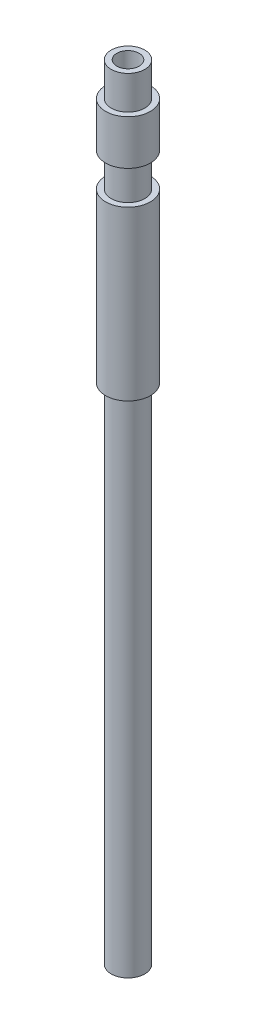
ISO-10303-21;
HEADER;
FILE_DESCRIPTION(('STEP AP214'),'2;1');
FILE_NAME('part.step','',(''),(''),'','','');
FILE_SCHEMA(('AUTOMOTIVE_DESIGN { 1 0 10303 214 1 1 1 1 }'));
ENDSEC;
DATA;
#1=APPLICATION_CONTEXT('core data for automotive mechanical design processes');
#2=APPLICATION_PROTOCOL_DEFINITION('international standard','automotive_design',2000,#1);
#3=PRODUCT_CONTEXT('',#1,'mechanical');
#4=PRODUCT('Part','Part','',(#3));
#5=PRODUCT_RELATED_PRODUCT_CATEGORY('part','',(#4));
#6=PRODUCT_DEFINITION_FORMATION('','',#4);
#7=PRODUCT_DEFINITION_CONTEXT('part definition',#1,'design');
#8=PRODUCT_DEFINITION('design','',#6,#7);
#9=PRODUCT_DEFINITION_SHAPE('','',#8);
#10=(LENGTH_UNIT() NAMED_UNIT(*) SI_UNIT(.MILLI.,.METRE.));
#11=(NAMED_UNIT(*) PLANE_ANGLE_UNIT() SI_UNIT($,.RADIAN.));
#12=(NAMED_UNIT(*) SI_UNIT($,.STERADIAN.) SOLID_ANGLE_UNIT());
#13=UNCERTAINTY_MEASURE_WITH_UNIT(LENGTH_MEASURE(1.E-05),#10,'distance_accuracy_value','');
#14=(GEOMETRIC_REPRESENTATION_CONTEXT(3) GLOBAL_UNCERTAINTY_ASSIGNED_CONTEXT((#13)) GLOBAL_UNIT_ASSIGNED_CONTEXT((#10,
#11,#12)) REPRESENTATION_CONTEXT('',''));
#15=CARTESIAN_POINT('',(0.,0.,0.));
#16=DIRECTION('',(0.,0.,1.));
#17=DIRECTION('',(1.,0.,0.));
#18=AXIS2_PLACEMENT_3D('',#15,#16,#17);
#19=CARTESIAN_POINT('',(0.,0.,0.));
#20=DIRECTION('',(0.,1.,0.));
#21=DIRECTION('',(0.,0.,1.));
#22=AXIS2_PLACEMENT_3D('',#19,#20,#21);
#23=PLANE('',#22);
#24=CARTESIAN_POINT('',(0.,0.,0.));
#25=DIRECTION('',(0.,1.,0.));
#26=DIRECTION('',(0.,0.,1.));
#27=AXIS2_PLACEMENT_3D('',#24,#25,#26);
#28=CIRCLE('',#27,1.);
#29=CARTESIAN_POINT('',(0.,0.,1.));
#30=VERTEX_POINT('',#29);
#31=EDGE_CURVE('E37',#30,#30,#28,.T.);
#32=ORIENTED_EDGE('',*,*,#31,.T.);
#33=EDGE_LOOP('',(#32));
#34=FACE_BOUND('',#33,.T.);
#35=CARTESIAN_POINT('',(0.,0.,0.));
#36=DIRECTION('',(0.,-1.,0.));
#37=DIRECTION('',(0.,0.,-1.));
#38=AXIS2_PLACEMENT_3D('',#35,#36,#37);
#39=CIRCLE('',#38,1.5);
#40=CARTESIAN_POINT('',(0.,0.,-1.5));
#41=VERTEX_POINT('',#40);
#42=EDGE_CURVE('E72',#41,#41,#39,.T.);
#43=ORIENTED_EDGE('',*,*,#42,.T.);
#44=EDGE_LOOP('',(#43));
#45=FACE_BOUND('',#44,.T.);
#46=ADVANCED_FACE('F33',(#34,#45),#23,.F.);
#47=CARTESIAN_POINT('',(0.,70.,0.));
#48=DIRECTION('',(0.,-1.,0.));
#49=DIRECTION('',(0.,0.,-1.));
#50=AXIS2_PLACEMENT_3D('',#47,#48,#49);
#51=CYLINDRICAL_SURFACE('',#50,2.);
#52=CARTESIAN_POINT('',(0.,45.,0.));
#53=DIRECTION('',(0.,-1.,0.));
#54=DIRECTION('',(0.,0.,-1.));
#55=AXIS2_PLACEMENT_3D('',#52,#53,#54);
#56=CIRCLE('',#55,1.99999999999999);
#57=CARTESIAN_POINT('',(0.,45.,-1.99999999999999));
#58=VERTEX_POINT('',#57);
#59=EDGE_CURVE('E66',#58,#58,#56,.T.);
#60=ORIENTED_EDGE('',*,*,#59,.F.);
#61=EDGE_LOOP('',(#60));
#62=FACE_BOUND('',#61,.T.);
#63=CARTESIAN_POINT('',(0.,60.,0.));
#64=DIRECTION('',(0.,1.,0.));
#65=DIRECTION('',(0.,0.,1.));
#66=AXIS2_PLACEMENT_3D('',#63,#64,#65);
#67=CIRCLE('',#66,2.);
#68=CARTESIAN_POINT('',(0.,60.,2.));
#69=VERTEX_POINT('',#68);
#70=EDGE_CURVE('E54',#69,#69,#67,.T.);
#71=ORIENTED_EDGE('',*,*,#70,.F.);
#72=EDGE_LOOP('',(#71));
#73=FACE_BOUND('',#72,.T.);
#74=ADVANCED_FACE('F35',(#62,#73),#51,.T.);
#75=CARTESIAN_POINT('',(0.,67.,0.));
#76=DIRECTION('',(0.,1.,0.));
#77=DIRECTION('',(0.,0.,1.));
#78=AXIS2_PLACEMENT_3D('',#75,#76,#77);
#79=CIRCLE('',#78,2.);
#80=CARTESIAN_POINT('',(0.,67.,2.));
#81=VERTEX_POINT('',#80);
#82=EDGE_CURVE('E44',#81,#81,#79,.T.);
#83=ORIENTED_EDGE('',*,*,#82,.F.);
#84=EDGE_LOOP('',(#83));
#85=FACE_BOUND('',#84,.T.);
#86=CARTESIAN_POINT('',(0.,63.,0.));
#87=DIRECTION('',(0.,1.,0.));
#88=DIRECTION('',(0.,0.,1.));
#89=AXIS2_PLACEMENT_3D('',#86,#87,#88);
#90=CIRCLE('',#89,2.);
#91=CARTESIAN_POINT('',(0.,63.,2.));
#92=VERTEX_POINT('',#91);
#93=EDGE_CURVE('E63',#92,#92,#90,.T.);
#94=ORIENTED_EDGE('',*,*,#93,.T.);
#95=EDGE_LOOP('',(#94));
#96=FACE_BOUND('',#95,.T.);
#97=ADVANCED_FACE('F92',(#85,#96),#51,.T.);
#98=CARTESIAN_POINT('',(0.,70.,0.));
#99=DIRECTION('',(0.,1.,0.));
#100=DIRECTION('',(0.,0.,1.));
#101=AXIS2_PLACEMENT_3D('',#98,#99,#100);
#102=PLANE('',#101);
#103=CARTESIAN_POINT('',(0.,70.,0.));
#104=DIRECTION('',(0.,1.,0.));
#105=DIRECTION('',(0.,0.,1.));
#106=AXIS2_PLACEMENT_3D('',#103,#104,#105);
#107=CIRCLE('',#106,1.);
#108=CARTESIAN_POINT('',(0.,70.,1.));
#109=VERTEX_POINT('',#108);
#110=EDGE_CURVE('E10',#109,#109,#107,.T.);
#111=ORIENTED_EDGE('',*,*,#110,.F.);
#112=EDGE_LOOP('',(#111));
#113=FACE_BOUND('',#112,.T.);
#114=CARTESIAN_POINT('',(0.,70.,0.));
#115=DIRECTION('',(0.,1.,0.));
#116=DIRECTION('',(0.,0.,1.));
#117=AXIS2_PLACEMENT_3D('',#114,#115,#116);
#118=CIRCLE('',#117,1.5);
#119=CARTESIAN_POINT('',(0.,70.,1.5));
#120=VERTEX_POINT('',#119);
#121=EDGE_CURVE('E51',#120,#120,#118,.T.);
#122=ORIENTED_EDGE('',*,*,#121,.T.);
#123=EDGE_LOOP('',(#122));
#124=FACE_BOUND('',#123,.T.);
#125=ADVANCED_FACE('F114',(#113,#124),#102,.T.);
#126=CARTESIAN_POINT('',(0.,70.,0.));
#127=DIRECTION('',(0.,-1.,0.));
#128=DIRECTION('',(0.,0.,-1.));
#129=AXIS2_PLACEMENT_3D('',#126,#127,#128);
#130=CYLINDRICAL_SURFACE('',#129,1.);
#131=ORIENTED_EDGE('',*,*,#110,.T.);
#132=EDGE_LOOP('',(#131));
#133=FACE_BOUND('',#132,.T.);
#134=ORIENTED_EDGE('',*,*,#31,.F.);
#135=EDGE_LOOP('',(#134));
#136=FACE_BOUND('',#135,.T.);
#137=ADVANCED_FACE('F119',(#133,#136),#130,.F.);
#138=CARTESIAN_POINT('',(2.,67.,0.));
#139=DIRECTION('',(0.,1.,0.));
#140=DIRECTION('',(0.,0.,1.));
#141=AXIS2_PLACEMENT_3D('',#138,#139,#140);
#142=PLANE('',#141);
#143=ORIENTED_EDGE('',*,*,#82,.T.);
#144=EDGE_LOOP('',(#143));
#145=FACE_BOUND('',#144,.T.);
#146=CARTESIAN_POINT('',(0.,67.,0.));
#147=DIRECTION('',(0.,1.,0.));
#148=DIRECTION('',(0.,0.,1.));
#149=AXIS2_PLACEMENT_3D('',#146,#147,#148);
#150=CIRCLE('',#149,1.5);
#151=CARTESIAN_POINT('',(0.,67.,1.5));
#152=VERTEX_POINT('',#151);
#153=EDGE_CURVE('E48',#152,#152,#150,.T.);
#154=ORIENTED_EDGE('',*,*,#153,.F.);
#155=EDGE_LOOP('',(#154));
#156=FACE_BOUND('',#155,.T.);
#157=ADVANCED_FACE('F130',(#145,#156),#142,.T.);
#158=CARTESIAN_POINT('',(0.,70.,0.));
#159=DIRECTION('',(0.,1.,0.));
#160=DIRECTION('',(0.,0.,1.));
#161=AXIS2_PLACEMENT_3D('',#158,#159,#160);
#162=CYLINDRICAL_SURFACE('',#161,1.5);
#163=ORIENTED_EDGE('',*,*,#153,.T.);
#164=EDGE_LOOP('',(#163));
#165=FACE_BOUND('',#164,.T.);
#166=ORIENTED_EDGE('',*,*,#121,.F.);
#167=EDGE_LOOP('',(#166));
#168=FACE_BOUND('',#167,.T.);
#169=ADVANCED_FACE('F99',(#165,#168),#162,.T.);
#170=CARTESIAN_POINT('',(2.,60.,0.));
#171=DIRECTION('',(0.,1.,0.));
#172=DIRECTION('',(0.,0.,1.));
#173=AXIS2_PLACEMENT_3D('',#170,#171,#172);
#174=PLANE('',#173);
#175=ORIENTED_EDGE('',*,*,#70,.T.);
#176=EDGE_LOOP('',(#175));
#177=FACE_BOUND('',#176,.T.);
#178=CARTESIAN_POINT('',(0.,60.,0.));
#179=DIRECTION('',(0.,1.,0.));
#180=DIRECTION('',(0.,0.,1.));
#181=AXIS2_PLACEMENT_3D('',#178,#179,#180);
#182=CIRCLE('',#181,1.5);
#183=CARTESIAN_POINT('',(0.,60.,1.5));
#184=VERTEX_POINT('',#183);
#185=EDGE_CURVE('E57',#184,#184,#182,.T.);
#186=ORIENTED_EDGE('',*,*,#185,.F.);
#187=EDGE_LOOP('',(#186));
#188=FACE_BOUND('',#187,.T.);
#189=ADVANCED_FACE('F95',(#177,#188),#174,.T.);
#190=CARTESIAN_POINT('',(0.,70.,0.));
#191=DIRECTION('',(0.,1.,0.));
#192=DIRECTION('',(0.,0.,1.));
#193=AXIS2_PLACEMENT_3D('',#190,#191,#192);
#194=CYLINDRICAL_SURFACE('',#193,1.5);
#195=ORIENTED_EDGE('',*,*,#185,.T.);
#196=EDGE_LOOP('',(#195));
#197=FACE_BOUND('',#196,.T.);
#198=CARTESIAN_POINT('',(0.,63.,0.));
#199=DIRECTION('',(0.,1.,0.));
#200=DIRECTION('',(0.,0.,1.));
#201=AXIS2_PLACEMENT_3D('',#198,#199,#200);
#202=CIRCLE('',#201,1.5);
#203=CARTESIAN_POINT('',(0.,63.,1.5));
#204=VERTEX_POINT('',#203);
#205=EDGE_CURVE('E60',#204,#204,#202,.T.);
#206=ORIENTED_EDGE('',*,*,#205,.F.);
#207=EDGE_LOOP('',(#206));
#208=FACE_BOUND('',#207,.T.);
#209=ADVANCED_FACE('F98',(#197,#208),#194,.T.);
#210=CARTESIAN_POINT('',(2.,63.,0.));
#211=DIRECTION('',(0.,-1.,0.));
#212=DIRECTION('',(0.,0.,-1.));
#213=AXIS2_PLACEMENT_3D('',#210,#211,#212);
#214=PLANE('',#213);
#215=ORIENTED_EDGE('',*,*,#205,.T.);
#216=EDGE_LOOP('',(#215));
#217=FACE_BOUND('',#216,.T.);
#218=ORIENTED_EDGE('',*,*,#93,.F.);
#219=EDGE_LOOP('',(#218));
#220=FACE_BOUND('',#219,.T.);
#221=ADVANCED_FACE('F86',(#217,#220),#214,.T.);
#222=CARTESIAN_POINT('',(1.99999999999999,45.,0.));
#223=DIRECTION('',(0.,1.,0.));
#224=DIRECTION('',(0.,0.,1.));
#225=AXIS2_PLACEMENT_3D('',#222,#223,#224);
#226=PLANE('',#225);
#227=CARTESIAN_POINT('',(0.,45.,0.));
#228=DIRECTION('',(0.,-1.,0.));
#229=DIRECTION('',(0.,0.,-1.));
#230=AXIS2_PLACEMENT_3D('',#227,#228,#229);
#231=CIRCLE('',#230,1.49999999999999);
#232=CARTESIAN_POINT('',(0.,45.,-1.49999999999999));
#233=VERTEX_POINT('',#232);
#234=EDGE_CURVE('E69',#233,#233,#231,.T.);
#235=ORIENTED_EDGE('',*,*,#234,.F.);
#236=EDGE_LOOP('',(#235));
#237=FACE_BOUND('',#236,.T.);
#238=ORIENTED_EDGE('',*,*,#59,.T.);
#239=EDGE_LOOP('',(#238));
#240=FACE_BOUND('',#239,.T.);
#241=ADVANCED_FACE('F80',(#237,#240),#226,.F.);
#242=CARTESIAN_POINT('',(0.,0.,0.));
#243=DIRECTION('',(0.,-1.,0.));
#244=DIRECTION('',(0.,0.,-1.));
#245=AXIS2_PLACEMENT_3D('',#242,#243,#244);
#246=CYLINDRICAL_SURFACE('',#245,1.5);
#247=ORIENTED_EDGE('',*,*,#42,.F.);
#248=EDGE_LOOP('',(#247));
#249=FACE_BOUND('',#248,.T.);
#250=ORIENTED_EDGE('',*,*,#234,.T.);
#251=EDGE_LOOP('',(#250));
#252=FACE_BOUND('',#251,.T.);
#253=ADVANCED_FACE('F77',(#249,#252),#246,.T.);
#254=CLOSED_SHELL('',(#46,#74,#97,#125,#137,#157,#169,#189,#209,#221,#241,#253));
#255=MANIFOLD_SOLID_BREP('B2',#254);
#256=ADVANCED_BREP_SHAPE_REPRESENTATION('',(#18,#255),#14);
#257=SHAPE_DEFINITION_REPRESENTATION(#9,#256);
ENDSEC;
END-ISO-10303-21;
